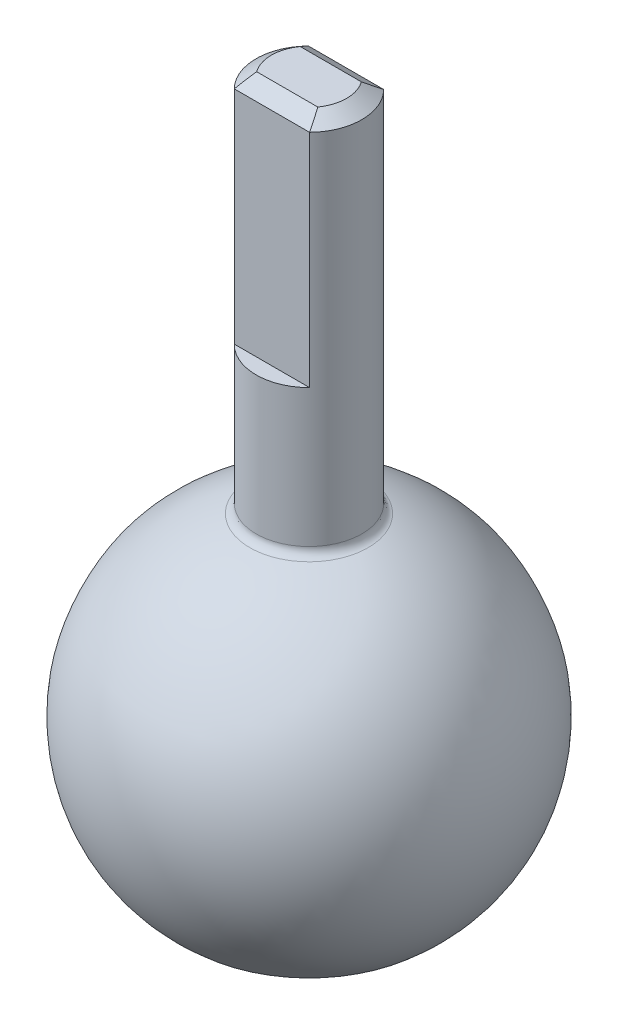
ISO-10303-21;
HEADER;
FILE_DESCRIPTION(('STEP AP214'),'2;1');
FILE_NAME('part.step','',(''),(''),'','','');
FILE_SCHEMA(('AUTOMOTIVE_DESIGN { 1 0 10303 214 1 1 1 1 }'));
ENDSEC;
DATA;
#1=APPLICATION_CONTEXT('core data for automotive mechanical design processes');
#2=APPLICATION_PROTOCOL_DEFINITION('international standard','automotive_design',2000,#1);
#3=PRODUCT_CONTEXT('',#1,'mechanical');
#4=PRODUCT('Part','Part','',(#3));
#5=PRODUCT_RELATED_PRODUCT_CATEGORY('part','',(#4));
#6=PRODUCT_DEFINITION_FORMATION('','',#4);
#7=PRODUCT_DEFINITION_CONTEXT('part definition',#1,'design');
#8=PRODUCT_DEFINITION('design','',#6,#7);
#9=PRODUCT_DEFINITION_SHAPE('','',#8);
#10=(LENGTH_UNIT() NAMED_UNIT(*) SI_UNIT(.MILLI.,.METRE.));
#11=(NAMED_UNIT(*) PLANE_ANGLE_UNIT() SI_UNIT($,.RADIAN.));
#12=(NAMED_UNIT(*) SI_UNIT($,.STERADIAN.) SOLID_ANGLE_UNIT());
#13=UNCERTAINTY_MEASURE_WITH_UNIT(LENGTH_MEASURE(1.E-05),#10,'distance_accuracy_value','');
#14=(GEOMETRIC_REPRESENTATION_CONTEXT(3) GLOBAL_UNCERTAINTY_ASSIGNED_CONTEXT((#13)) GLOBAL_UNIT_ASSIGNED_CONTEXT((#10,
#11,#12)) REPRESENTATION_CONTEXT('',''));
#15=CARTESIAN_POINT('',(0.,0.,0.));
#16=DIRECTION('',(0.,0.,1.));
#17=DIRECTION('',(1.,0.,0.));
#18=AXIS2_PLACEMENT_3D('',#15,#16,#17);
#19=CARTESIAN_POINT('',(0.,0.,0.));
#20=DIRECTION('',(0.,-1.,0.));
#21=DIRECTION('',(-1.,0.,0.));
#22=AXIS2_PLACEMENT_3D('',#19,#20,#21);
#23=SPHERICAL_SURFACE('',#22,20.);
#24=CARTESIAN_POINT('',(0.,18.9547737183016,0.));
#25=DIRECTION('',(0.,-1.,0.));
#26=DIRECTION('',(0.,0.,-1.));
#27=AXIS2_PLACEMENT_3D('',#24,#25,#26);
#28=CIRCLE('',#27,6.38095238095238);
#29=CARTESIAN_POINT('',(0.,18.9547737183016,-6.38095238095238));
#30=VERTEX_POINT('',#29);
#31=EDGE_CURVE('E140',#30,#30,#28,.T.);
#32=ORIENTED_EDGE('',*,*,#31,.T.);
#33=EDGE_LOOP('',(#32));
#34=FACE_BOUND('',#33,.T.);
#35=CARTESIAN_POINT('',(0.,-15.4502427165401,0.));
#36=DIRECTION('',(0.,1.,0.));
#37=DIRECTION('',(0.,0.,1.));
#38=AXIS2_PLACEMENT_3D('',#35,#36,#37);
#39=CIRCLE('',#38,12.7);
#40=CARTESIAN_POINT('',(0.,-15.4502427165401,12.7));
#41=VERTEX_POINT('',#40);
#42=EDGE_CURVE('E118',#41,#41,#39,.T.);
#43=ORIENTED_EDGE('',*,*,#42,.T.);
#44=EDGE_LOOP('',(#43));
#45=FACE_BOUND('',#44,.T.);
#46=CARTESIAN_POINT('',(0.,0.,-15.4502427165401));
#47=DIRECTION('',(0.,0.,1.));
#48=DIRECTION('',(1.,0.,0.));
#49=AXIS2_PLACEMENT_3D('',#46,#47,#48);
#50=CIRCLE('',#49,12.7);
#51=CARTESIAN_POINT('',(12.7,0.,-15.4502427165401));
#52=VERTEX_POINT('',#51);
#53=EDGE_CURVE('E123',#52,#52,#50,.T.);
#54=ORIENTED_EDGE('',*,*,#53,.T.);
#55=EDGE_LOOP('',(#54));
#56=FACE_BOUND('',#55,.T.);
#57=CARTESIAN_POINT('',(-15.4502427165401,0.,0.));
#58=DIRECTION('',(1.,0.,0.));
#59=DIRECTION('',(0.,0.,-1.));
#60=AXIS2_PLACEMENT_3D('',#57,#58,#59);
#61=CIRCLE('',#60,12.7);
#62=CARTESIAN_POINT('',(-15.4502427165401,0.,-12.7));
#63=VERTEX_POINT('',#62);
#64=EDGE_CURVE('E127',#63,#63,#61,.T.);
#65=ORIENTED_EDGE('',*,*,#64,.T.);
#66=EDGE_LOOP('',(#65));
#67=FACE_BOUND('',#66,.T.);
#68=ADVANCED_FACE('F35',(#34,#45,#56,#67),#23,.T.);
#69=CARTESIAN_POINT('',(-20.001,0.,0.));
#70=DIRECTION('',(1.,0.,0.));
#71=DIRECTION('',(0.,0.,-1.));
#72=AXIS2_PLACEMENT_3D('',#69,#70,#71);
#73=CYLINDRICAL_SURFACE('',#72,12.7);
#74=ORIENTED_EDGE('',*,*,#64,.F.);
#75=EDGE_LOOP('',(#74));
#76=FACE_BOUND('',#75,.T.);
#77=CARTESIAN_POINT('',(-14.1318788559767,0.,0.));
#78=DIRECTION('',(1.,0.,0.));
#79=DIRECTION('',(0.,0.,-1.));
#80=AXIS2_PLACEMENT_3D('',#77,#78,#79);
#81=CIRCLE('',#80,12.7);
#82=CARTESIAN_POINT('',(-14.1318788559767,0.,-12.7));
#83=VERTEX_POINT('',#82);
#84=EDGE_CURVE('E130',#83,#83,#81,.F.);
#85=ORIENTED_EDGE('',*,*,#84,.F.);
#86=EDGE_LOOP('',(#85));
#87=FACE_BOUND('',#86,.T.);
#88=ADVANCED_FACE('F190',(#76,#87),#73,.F.);
#89=CARTESIAN_POINT('',(0.,0.,0.));
#90=DIRECTION('',(0.,-1.,0.));
#91=DIRECTION('',(-1.,0.,0.));
#92=AXIS2_PLACEMENT_3D('',#89,#90,#91);
#93=SPHERICAL_SURFACE('',#92,19.);
#94=CARTESIAN_POINT('',(0.,-14.1318788559767,0.));
#95=DIRECTION('',(0.,1.,0.));
#96=DIRECTION('',(0.,0.,1.));
#97=AXIS2_PLACEMENT_3D('',#94,#95,#96);
#98=CIRCLE('',#97,12.7);
#99=CARTESIAN_POINT('',(0.,-14.1318788559767,12.7));
#100=VERTEX_POINT('',#99);
#101=EDGE_CURVE('E122',#100,#100,#98,.F.);
#102=ORIENTED_EDGE('',*,*,#101,.T.);
#103=EDGE_LOOP('',(#102));
#104=FACE_BOUND('',#103,.T.);
#105=CARTESIAN_POINT('',(0.,0.,-14.1318788559767));
#106=DIRECTION('',(0.,0.,1.));
#107=DIRECTION('',(1.,0.,0.));
#108=AXIS2_PLACEMENT_3D('',#105,#106,#107);
#109=CIRCLE('',#108,12.7);
#110=CARTESIAN_POINT('',(12.7,0.,-14.1318788559767));
#111=VERTEX_POINT('',#110);
#112=EDGE_CURVE('E126',#111,#111,#109,.F.);
#113=ORIENTED_EDGE('',*,*,#112,.T.);
#114=EDGE_LOOP('',(#113));
#115=FACE_BOUND('',#114,.T.);
#116=ORIENTED_EDGE('',*,*,#84,.T.);
#117=EDGE_LOOP('',(#116));
#118=FACE_BOUND('',#117,.T.);
#119=ADVANCED_FACE('F196',(#104,#115,#118),#93,.F.);
#120=CARTESIAN_POINT('',(0.,0.,-20.001));
#121=DIRECTION('',(0.,0.,1.));
#122=DIRECTION('',(1.,0.,0.));
#123=AXIS2_PLACEMENT_3D('',#120,#121,#122);
#124=CYLINDRICAL_SURFACE('',#123,12.7);
#125=ORIENTED_EDGE('',*,*,#53,.F.);
#126=EDGE_LOOP('',(#125));
#127=FACE_BOUND('',#126,.T.);
#128=ORIENTED_EDGE('',*,*,#112,.F.);
#129=EDGE_LOOP('',(#128));
#130=FACE_BOUND('',#129,.T.);
#131=ADVANCED_FACE('F203',(#127,#130),#124,.F.);
#132=CARTESIAN_POINT('',(0.,-20.001,0.));
#133=DIRECTION('',(0.,1.,0.));
#134=DIRECTION('',(0.,0.,1.));
#135=AXIS2_PLACEMENT_3D('',#132,#133,#134);
#136=CYLINDRICAL_SURFACE('',#135,12.7);
#137=ORIENTED_EDGE('',*,*,#42,.F.);
#138=EDGE_LOOP('',(#137));
#139=FACE_BOUND('',#138,.T.);
#140=ORIENTED_EDGE('',*,*,#101,.F.);
#141=EDGE_LOOP('',(#140));
#142=FACE_BOUND('',#141,.T.);
#143=ADVANCED_FACE('F217',(#139,#142),#136,.F.);
#144=CARTESIAN_POINT('',(0.,-20.001,0.));
#145=DIRECTION('',(0.,1.,0.));
#146=DIRECTION('',(0.,0.,1.));
#147=AXIS2_PLACEMENT_3D('',#144,#145,#146);
#148=CYLINDRICAL_SURFACE('',#147,5.7);
#149=CARTESIAN_POINT('',(0.,19.9025124042167,0.));
#150=DIRECTION('',(0.,-1.,0.));
#151=DIRECTION('',(0.,0.,-1.));
#152=AXIS2_PLACEMENT_3D('',#149,#150,#151);
#153=CIRCLE('',#152,5.7);
#154=CARTESIAN_POINT('',(0.,19.9025124042167,-5.7));
#155=VERTEX_POINT('',#154);
#156=EDGE_CURVE('E133',#155,#155,#153,.F.);
#157=ORIENTED_EDGE('',*,*,#156,.T.);
#158=EDGE_LOOP('',(#157));
#159=FACE_BOUND('',#158,.T.);
#160=DIRECTION('',(0.,1.,0.));
#161=VECTOR('',#160,1.);
#162=CARTESIAN_POINT('',(-4.06078810084939,34.75,4.));
#163=LINE('',#162,#161);
#164=CARTESIAN_POINT('',(-4.06078810084939,34.75,4.));
#165=VERTEX_POINT('',#164);
#166=CARTESIAN_POINT('',(-4.06078810084939,58.594657561954,4.));
#167=VERTEX_POINT('',#166);
#168=EDGE_CURVE('E104',#165,#167,#163,.T.);
#169=ORIENTED_EDGE('',*,*,#168,.T.);
#170=CARTESIAN_POINT('',(0.,58.594657561954,0.));
#171=DIRECTION('',(0.,1.,0.));
#172=DIRECTION('',(0.,0.,1.));
#173=AXIS2_PLACEMENT_3D('',#170,#171,#172);
#174=CIRCLE('',#173,5.7);
#175=CARTESIAN_POINT('',(-4.06078810084939,58.594657561954,-4.));
#176=VERTEX_POINT('',#175);
#177=EDGE_CURVE('E153',#167,#176,#174,.F.);
#178=ORIENTED_EDGE('',*,*,#177,.T.);
#179=DIRECTION('',(0.,1.,0.));
#180=VECTOR('',#179,1.);
#181=CARTESIAN_POINT('',(-4.06078810084939,34.75,-4.));
#182=LINE('',#181,#180);
#183=CARTESIAN_POINT('',(-4.06078810084939,34.75,-4.));
#184=VERTEX_POINT('',#183);
#185=EDGE_CURVE('E115',#184,#176,#182,.T.);
#186=ORIENTED_EDGE('',*,*,#185,.F.);
#187=CARTESIAN_POINT('',(0.,34.75,0.));
#188=DIRECTION('',(0.,1.,0.));
#189=DIRECTION('',(0.,0.,1.));
#190=AXIS2_PLACEMENT_3D('',#187,#188,#189);
#191=CIRCLE('',#190,5.7);
#192=CARTESIAN_POINT('',(4.06078810084939,34.75,-4.));
#193=VERTEX_POINT('',#192);
#194=EDGE_CURVE('E108',#193,#184,#191,.T.);
#195=ORIENTED_EDGE('',*,*,#194,.F.);
#196=DIRECTION('',(0.,1.,0.));
#197=VECTOR('',#196,1.);
#198=CARTESIAN_POINT('',(4.06078810084939,34.75,-4.));
#199=LINE('',#198,#197);
#200=CARTESIAN_POINT('',(4.06078810084939,58.594657561954,-4.));
#201=VERTEX_POINT('',#200);
#202=EDGE_CURVE('E116',#193,#201,#199,.T.);
#203=ORIENTED_EDGE('',*,*,#202,.T.);
#204=CARTESIAN_POINT('',(0.,58.594657561954,0.));
#205=DIRECTION('',(0.,1.,0.));
#206=DIRECTION('',(0.,0.,1.));
#207=AXIS2_PLACEMENT_3D('',#204,#205,#206);
#208=CIRCLE('',#207,5.7);
#209=CARTESIAN_POINT('',(4.06078810084939,58.594657561954,4.));
#210=VERTEX_POINT('',#209);
#211=EDGE_CURVE('E56',#201,#210,#208,.F.);
#212=ORIENTED_EDGE('',*,*,#211,.T.);
#213=DIRECTION('',(0.,1.,0.));
#214=VECTOR('',#213,1.);
#215=CARTESIAN_POINT('',(4.06078810084939,34.75,4.));
#216=LINE('',#215,#214);
#217=CARTESIAN_POINT('',(4.06078810084939,34.75,4.));
#218=VERTEX_POINT('',#217);
#219=EDGE_CURVE('E102',#218,#210,#216,.T.);
#220=ORIENTED_EDGE('',*,*,#219,.F.);
#221=CARTESIAN_POINT('',(0.,34.75,0.));
#222=DIRECTION('',(0.,1.,0.));
#223=DIRECTION('',(0.,0.,1.));
#224=AXIS2_PLACEMENT_3D('',#221,#222,#223);
#225=CIRCLE('',#224,5.7);
#226=EDGE_CURVE('E94',#165,#218,#225,.T.);
#227=ORIENTED_EDGE('',*,*,#226,.F.);
#228=EDGE_LOOP('',(#169,#178,#186,#195,#203,#212,#220,#227));
#229=FACE_BOUND('',#228,.T.);
#230=ADVANCED_FACE('F106',(#159,#229),#148,.T.);
#231=CARTESIAN_POINT('',(0.,59.75,0.));
#232=DIRECTION('',(0.,1.,0.));
#233=DIRECTION('',(0.,0.,1.));
#234=AXIS2_PLACEMENT_3D('',#231,#232,#233);
#235=PLANE('',#234);
#236=DIRECTION('',(-1.,0.,0.));
#237=VECTOR('',#236,1.);
#238=CARTESIAN_POINT('',(-4.06078810084939,59.75,-2.35));
#239=LINE('',#238,#237);
#240=CARTESIAN_POINT('',(3.29848450049413,59.75,-2.35));
#241=VERTEX_POINT('',#240);
#242=CARTESIAN_POINT('',(-3.29848450049413,59.75,-2.35));
#243=VERTEX_POINT('',#242);
#244=EDGE_CURVE('E147',#241,#243,#239,.T.);
#245=ORIENTED_EDGE('',*,*,#244,.T.);
#246=CARTESIAN_POINT('',(0.,59.75,0.));
#247=DIRECTION('',(0.,1.,0.));
#248=DIRECTION('',(0.,0.,1.));
#249=AXIS2_PLACEMENT_3D('',#246,#247,#248);
#250=CIRCLE('',#249,4.05);
#251=CARTESIAN_POINT('',(-3.29848450049413,59.75,2.35));
#252=VERTEX_POINT('',#251);
#253=EDGE_CURVE('E149',#243,#252,#250,.T.);
#254=ORIENTED_EDGE('',*,*,#253,.T.);
#255=DIRECTION('',(1.,0.,0.));
#256=VECTOR('',#255,1.);
#257=CARTESIAN_POINT('',(4.06078810084939,59.75,2.35));
#258=LINE('',#257,#256);
#259=CARTESIAN_POINT('',(3.29848450049413,59.75,2.35));
#260=VERTEX_POINT('',#259);
#261=EDGE_CURVE('E143',#252,#260,#258,.T.);
#262=ORIENTED_EDGE('',*,*,#261,.T.);
#263=CARTESIAN_POINT('',(0.,59.75,0.));
#264=DIRECTION('',(0.,1.,0.));
#265=DIRECTION('',(0.,0.,1.));
#266=AXIS2_PLACEMENT_3D('',#263,#264,#265);
#267=CIRCLE('',#266,4.05);
#268=EDGE_CURVE('E145',#260,#241,#267,.T.);
#269=ORIENTED_EDGE('',*,*,#268,.T.);
#270=EDGE_LOOP('',(#245,#254,#262,#269));
#271=FACE_BOUND('',#270,.T.);
#272=ADVANCED_FACE('F216',(#271),#235,.T.);
#273=CARTESIAN_POINT('',(-4.06078810084939,34.75,-4.));
#274=DIRECTION('',(0.,0.,1.));
#275=DIRECTION('',(1.,0.,0.));
#276=AXIS2_PLACEMENT_3D('',#273,#274,#275);
#277=PLANE('',#276);
#278=ORIENTED_EDGE('',*,*,#185,.T.);
#279=DIRECTION('',(1.,0.,0.));
#280=VECTOR('',#279,1.);
#281=CARTESIAN_POINT('',(4.06078810084939,58.594657561954,-4.));
#282=LINE('',#281,#280);
#283=EDGE_CURVE('E48',#176,#201,#282,.T.);
#284=ORIENTED_EDGE('',*,*,#283,.T.);
#285=ORIENTED_EDGE('',*,*,#202,.F.);
#286=DIRECTION('',(1.,0.,0.));
#287=VECTOR('',#286,1.);
#288=CARTESIAN_POINT('',(-4.06078810084939,34.75,-4.));
#289=LINE('',#288,#287);
#290=EDGE_CURVE('E112',#184,#193,#289,.T.);
#291=ORIENTED_EDGE('',*,*,#290,.F.);
#292=EDGE_LOOP('',(#278,#284,#285,#291));
#293=FACE_BOUND('',#292,.T.);
#294=ADVANCED_FACE('F223',(#293),#277,.F.);
#295=CARTESIAN_POINT('',(0.,34.75,0.));
#296=DIRECTION('',(0.,1.,0.));
#297=DIRECTION('',(0.,0.,1.));
#298=AXIS2_PLACEMENT_3D('',#295,#296,#297);
#299=PLANE('',#298);
#300=ORIENTED_EDGE('',*,*,#194,.T.);
#301=ORIENTED_EDGE('',*,*,#290,.T.);
#302=EDGE_LOOP('',(#300,#301));
#303=FACE_BOUND('',#302,.T.);
#304=ADVANCED_FACE('F258',(#303),#299,.T.);
#305=CARTESIAN_POINT('',(-4.06078810084939,34.75,4.));
#306=DIRECTION('',(0.,0.,-1.));
#307=DIRECTION('',(-1.,0.,0.));
#308=AXIS2_PLACEMENT_3D('',#305,#306,#307);
#309=PLANE('',#308);
#310=ORIENTED_EDGE('',*,*,#219,.T.);
#311=DIRECTION('',(-1.,0.,0.));
#312=VECTOR('',#311,1.);
#313=CARTESIAN_POINT('',(-4.06078810084939,58.594657561954,4.));
#314=LINE('',#313,#312);
#315=EDGE_CURVE('E11',#210,#167,#314,.T.);
#316=ORIENTED_EDGE('',*,*,#315,.T.);
#317=ORIENTED_EDGE('',*,*,#168,.F.);
#318=DIRECTION('',(-1.,0.,0.));
#319=VECTOR('',#318,1.);
#320=CARTESIAN_POINT('',(-4.06078810084939,34.75,4.));
#321=LINE('',#320,#319);
#322=EDGE_CURVE('E97',#218,#165,#321,.T.);
#323=ORIENTED_EDGE('',*,*,#322,.F.);
#324=EDGE_LOOP('',(#310,#316,#317,#323));
#325=FACE_BOUND('',#324,.T.);
#326=ADVANCED_FACE('F101',(#325),#309,.F.);
#327=CARTESIAN_POINT('',(0.,34.75,0.));
#328=DIRECTION('',(0.,1.,0.));
#329=DIRECTION('',(0.,0.,1.));
#330=AXIS2_PLACEMENT_3D('',#327,#328,#329);
#331=PLANE('',#330);
#332=ORIENTED_EDGE('',*,*,#226,.T.);
#333=ORIENTED_EDGE('',*,*,#322,.T.);
#334=EDGE_LOOP('',(#332,#333));
#335=FACE_BOUND('',#334,.T.);
#336=ADVANCED_FACE('F96',(#335),#331,.T.);
#337=CARTESIAN_POINT('',(0.,19.9025124042167,0.));
#338=DIRECTION('',(0.,-1.,0.));
#339=DIRECTION('',(0.,0.,-1.));
#340=AXIS2_PLACEMENT_3D('',#337,#338,#339);
#341=TOROIDAL_SURFACE('',#340,6.7,1.);
#342=ORIENTED_EDGE('',*,*,#31,.F.);
#343=EDGE_LOOP('',(#342));
#344=FACE_BOUND('',#343,.T.);
#345=ORIENTED_EDGE('',*,*,#156,.F.);
#346=EDGE_LOOP('',(#345));
#347=FACE_BOUND('',#346,.T.);
#348=ADVANCED_FACE('F186',(#344,#347),#341,.F.);
#349=CARTESIAN_POINT('',(0.,59.75,0.));
#350=DIRECTION('',(0.,-1.,0.));
#351=DIRECTION('',(0.,0.,-1.));
#352=AXIS2_PLACEMENT_3D('',#349,#350,#351);
#353=CONICAL_SURFACE('',#352,4.05,0.959931088596887);
#354=CARTESIAN_POINT('',(4.06078810084939,58.594657561954,4.));
#355=CARTESIAN_POINT('',(4.00254406263919,58.6920575237214,3.86089843874516));
#356=CARTESIAN_POINT('',(3.9431968682308,58.7892433887854,3.72210263927051));
#357=CARTESIAN_POINT('',(3.8220003759694,58.9830678004651,3.44529269207215));
#358=CARTESIAN_POINT('',(3.76015181677587,59.0797064991884,3.30727832711622));
#359=CARTESIAN_POINT('',(3.63361547484242,59.2723861590044,3.03210325501035));
#360=CARTESIAN_POINT('',(3.56892735437778,59.3684270474366,2.89494265163016));
#361=CARTESIAN_POINT('',(3.43627036811327,59.5597922136078,2.62164487100288));
#362=CARTESIAN_POINT('',(3.36830054333156,59.6551162723537,2.48550800651029));
#363=CARTESIAN_POINT('',(3.29848450049413,59.75,2.35));
#364=B_SPLINE_CURVE_WITH_KNOTS('',3,(#354,#355,#356,#357,#358,#359,#360,#361,#362,#363),
.UNSPECIFIED.,.F.,.F.,(4,2,2,2,4),(0.,0.538570860724734,1.07698382502451,1.61546100018435,
2.15409649329352),.UNSPECIFIED.);
#365=EDGE_CURVE('E339',#210,#260,#364,.T.);
#366=ORIENTED_EDGE('',*,*,#365,.F.);
#367=ORIENTED_EDGE('',*,*,#211,.F.);
#368=CARTESIAN_POINT('',(4.06078810084939,58.594657561954,-4.));
#369=CARTESIAN_POINT('',(4.00254406263919,58.6920575237214,-3.86089843874516));
#370=CARTESIAN_POINT('',(3.9431968682308,58.7892433887854,-3.72210263927051));
#371=CARTESIAN_POINT('',(3.8220003759694,58.9830678004651,-3.44529269207215));
#372=CARTESIAN_POINT('',(3.76015181677587,59.0797064991884,-3.30727832711622));
#373=CARTESIAN_POINT('',(3.63361547484242,59.2723861590044,-3.03210325501035));
#374=CARTESIAN_POINT('',(3.56892735437778,59.3684270474366,-2.89494265163016));
#375=CARTESIAN_POINT('',(3.43627036811327,59.5597922136078,-2.62164487100288));
#376=CARTESIAN_POINT('',(3.36830054333156,59.6551162723537,-2.48550800651029));
#377=CARTESIAN_POINT('',(3.29848450049413,59.75,-2.35));
#378=B_SPLINE_CURVE_WITH_KNOTS('',3,(#368,#369,#370,#371,#372,#373,#374,#375,#376,#377),
.UNSPECIFIED.,.F.,.F.,(4,2,2,2,4),(0.,0.538570860724734,1.07698382502451,1.61546100018435,
2.15409649329352),.UNSPECIFIED.);
#379=EDGE_CURVE('E40',#241,#201,#378,.F.);
#380=ORIENTED_EDGE('',*,*,#379,.F.);
#381=ORIENTED_EDGE('',*,*,#268,.F.);
#382=EDGE_LOOP('',(#366,#367,#380,#381));
#383=FACE_BOUND('',#382,.T.);
#384=ADVANCED_FACE('F37',(#383),#353,.T.);
#385=CARTESIAN_POINT('',(-4.06078810084939,58.594657561954,-4.));
#386=DIRECTION('',(0.,0.819152044288993,-0.573576436351044));
#387=DIRECTION('',(-1.,0.,0.));
#388=AXIS2_PLACEMENT_3D('',#385,#386,#387);
#389=PLANE('',#388);
#390=ORIENTED_EDGE('',*,*,#379,.T.);
#391=ORIENTED_EDGE('',*,*,#283,.F.);
#392=CARTESIAN_POINT('',(-4.06078810084939,58.594657561954,-4.));
#393=CARTESIAN_POINT('',(-4.00254406263919,58.6920575237214,-3.86089843874516));
#394=CARTESIAN_POINT('',(-3.9431968682308,58.7892433887854,-3.72210263927051));
#395=CARTESIAN_POINT('',(-3.8220003759694,58.9830678004651,-3.44529269207215));
#396=CARTESIAN_POINT('',(-3.76015181677587,59.0797064991884,-3.30727832711622));
#397=CARTESIAN_POINT('',(-3.63361547484242,59.2723861590044,-3.03210325501035));
#398=CARTESIAN_POINT('',(-3.56892735437778,59.3684270474366,-2.89494265163016));
#399=CARTESIAN_POINT('',(-3.43627036811327,59.5597922136078,-2.62164487100288));
#400=CARTESIAN_POINT('',(-3.36830054333156,59.6551162723537,-2.48550800651029));
#401=CARTESIAN_POINT('',(-3.29848450049413,59.75,-2.35));
#402=B_SPLINE_CURVE_WITH_KNOTS('',3,(#392,#393,#394,#395,#396,#397,#398,#399,#400,#401),
.UNSPECIFIED.,.F.,.F.,(4,2,2,2,4),(0.,0.538570860724734,1.07698382502451,1.61546100018435,
2.15409649329352),.UNSPECIFIED.);
#403=EDGE_CURVE('E164',#243,#176,#402,.F.);
#404=ORIENTED_EDGE('',*,*,#403,.F.);
#405=ORIENTED_EDGE('',*,*,#244,.F.);
#406=EDGE_LOOP('',(#390,#391,#404,#405));
#407=FACE_BOUND('',#406,.T.);
#408=ADVANCED_FACE('F175',(#407),#389,.T.);
#409=CARTESIAN_POINT('',(-4.06078810084939,58.594657561954,4.));
#410=DIRECTION('',(0.,0.819152044288993,0.573576436351044));
#411=DIRECTION('',(1.,0.,0.));
#412=AXIS2_PLACEMENT_3D('',#409,#410,#411);
#413=PLANE('',#412);
#414=ORIENTED_EDGE('',*,*,#365,.T.);
#415=ORIENTED_EDGE('',*,*,#261,.F.);
#416=CARTESIAN_POINT('',(-3.29848450049413,59.75,2.35));
#417=CARTESIAN_POINT('',(-3.36830054333155,59.6551162723537,2.48550800651029));
#418=CARTESIAN_POINT('',(-3.43627036811326,59.5597922136078,2.62164487100288));
#419=CARTESIAN_POINT('',(-3.56892735437778,59.3684270474366,2.89494265163016));
#420=CARTESIAN_POINT('',(-3.63361547484242,59.2723861590044,3.03210325501035));
#421=CARTESIAN_POINT('',(-3.76015181677587,59.0797064991884,3.30727832711622));
#422=CARTESIAN_POINT('',(-3.8220003759694,58.9830678004651,3.44529269207215));
#423=CARTESIAN_POINT('',(-3.9431968682308,58.7892433887854,3.72210263927051));
#424=CARTESIAN_POINT('',(-4.0025440626392,58.6920575237214,3.86089843874516));
#425=CARTESIAN_POINT('',(-4.0607881008494,58.594657561954,3.99999999999999));
#426=B_SPLINE_CURVE_WITH_KNOTS('',3,(#416,#417,#418,#419,#420,#421,#422,#423,#424,#425),
.UNSPECIFIED.,.F.,.F.,(4,2,2,2,4),(0.,0.538635493109176,1.07711266826901,1.61552563256879,
2.15409649329352),.UNSPECIFIED.);
#427=EDGE_CURVE('E157',#167,#252,#426,.F.);
#428=ORIENTED_EDGE('',*,*,#427,.F.);
#429=ORIENTED_EDGE('',*,*,#315,.F.);
#430=EDGE_LOOP('',(#414,#415,#428,#429));
#431=FACE_BOUND('',#430,.T.);
#432=ADVANCED_FACE('F168',(#431),#413,.T.);
#433=CARTESIAN_POINT('',(0.,59.75,0.));
#434=DIRECTION('',(0.,-1.,0.));
#435=DIRECTION('',(0.,0.,-1.));
#436=AXIS2_PLACEMENT_3D('',#433,#434,#435);
#437=CONICAL_SURFACE('',#436,4.05,0.959931088596887);
#438=ORIENTED_EDGE('',*,*,#403,.T.);
#439=ORIENTED_EDGE('',*,*,#177,.F.);
#440=ORIENTED_EDGE('',*,*,#427,.T.);
#441=ORIENTED_EDGE('',*,*,#253,.F.);
#442=EDGE_LOOP('',(#438,#439,#440,#441));
#443=FACE_BOUND('',#442,.T.);
#444=ADVANCED_FACE('F171',(#443),#437,.T.);
#445=CLOSED_SHELL('',(#68,#88,#119,#131,#143,#230,#272,#294,#304,#326,#336,#348,#384,#408,#432,#444));
#446=MANIFOLD_SOLID_BREP('B2',#445);
#447=ADVANCED_BREP_SHAPE_REPRESENTATION('',(#18,#446),#14);
#448=SHAPE_DEFINITION_REPRESENTATION(#9,#447);
ENDSEC;
END-ISO-10303-21;
